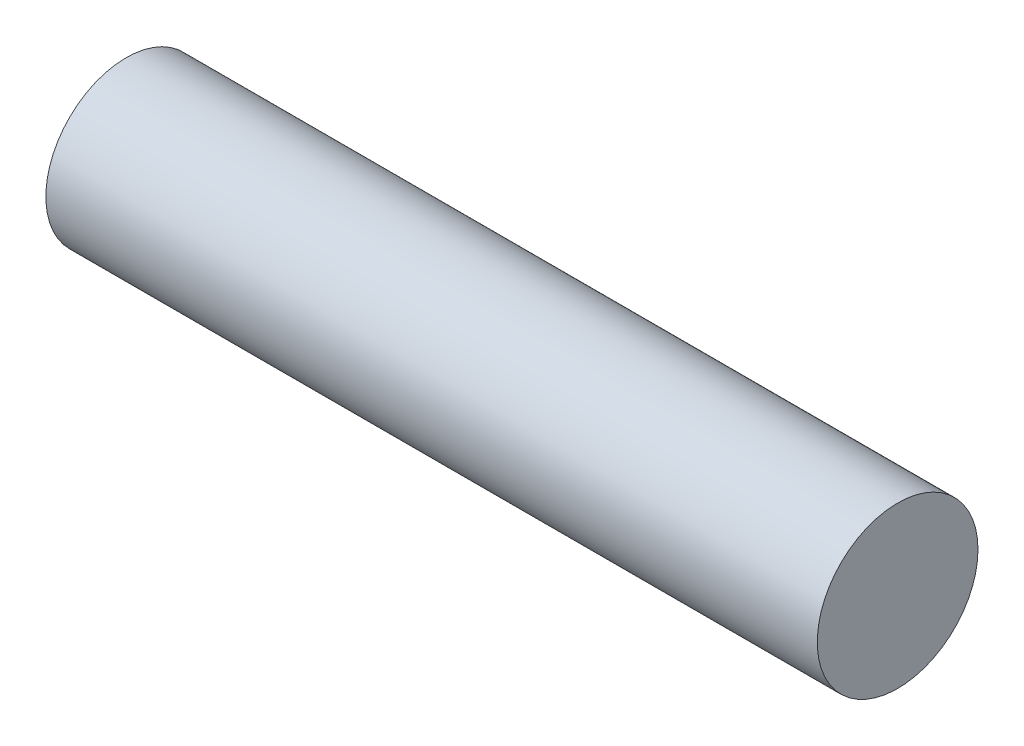
ISO-10303-21;
HEADER;
FILE_DESCRIPTION(('STEP AP214'),'2;1');
FILE_NAME('part.step','',(''),(''),'','','');
FILE_SCHEMA(('AUTOMOTIVE_DESIGN { 1 0 10303 214 1 1 1 1 }'));
ENDSEC;
DATA;
#1=APPLICATION_CONTEXT('core data for automotive mechanical design processes');
#2=APPLICATION_PROTOCOL_DEFINITION('international standard','automotive_design',2000,#1);
#3=PRODUCT_CONTEXT('',#1,'mechanical');
#4=PRODUCT('Part','Part','',(#3));
#5=PRODUCT_RELATED_PRODUCT_CATEGORY('part','',(#4));
#6=PRODUCT_DEFINITION_FORMATION('','',#4);
#7=PRODUCT_DEFINITION_CONTEXT('part definition',#1,'design');
#8=PRODUCT_DEFINITION('design','',#6,#7);
#9=PRODUCT_DEFINITION_SHAPE('','',#8);
#10=(LENGTH_UNIT() NAMED_UNIT(*) SI_UNIT(.MILLI.,.METRE.));
#11=(NAMED_UNIT(*) PLANE_ANGLE_UNIT() SI_UNIT($,.RADIAN.));
#12=(NAMED_UNIT(*) SI_UNIT($,.STERADIAN.) SOLID_ANGLE_UNIT());
#13=UNCERTAINTY_MEASURE_WITH_UNIT(LENGTH_MEASURE(1.E-05),#10,'distance_accuracy_value','');
#14=(GEOMETRIC_REPRESENTATION_CONTEXT(3) GLOBAL_UNCERTAINTY_ASSIGNED_CONTEXT((#13)) GLOBAL_UNIT_ASSIGNED_CONTEXT((#10,
#11,#12)) REPRESENTATION_CONTEXT('',''));
#15=CARTESIAN_POINT('',(0.,0.,0.));
#16=DIRECTION('',(0.,0.,1.));
#17=DIRECTION('',(1.,0.,0.));
#18=AXIS2_PLACEMENT_3D('',#15,#16,#17);
#19=CARTESIAN_POINT('',(-19.05,0.,0.));
#20=DIRECTION('',(1.,0.,0.));
#21=DIRECTION('',(0.,0.,-1.));
#22=AXIS2_PLACEMENT_3D('',#19,#20,#21);
#23=CYLINDRICAL_SURFACE('',#22,3.96875);
#24=CARTESIAN_POINT('',(-19.05,0.,0.));
#25=DIRECTION('',(1.,0.,0.));
#26=DIRECTION('',(0.,0.,-1.));
#27=AXIS2_PLACEMENT_3D('',#24,#25,#26);
#28=CIRCLE('',#27,3.96875);
#29=CARTESIAN_POINT('',(-19.05,0.,-3.96875));
#30=VERTEX_POINT('',#29);
#31=EDGE_CURVE('E10',#30,#30,#28,.T.);
#32=ORIENTED_EDGE('',*,*,#31,.T.);
#33=EDGE_LOOP('',(#32));
#34=FACE_BOUND('',#33,.T.);
#35=CARTESIAN_POINT('',(19.05,0.,0.));
#36=DIRECTION('',(1.,0.,0.));
#37=DIRECTION('',(0.,0.,-1.));
#38=AXIS2_PLACEMENT_3D('',#35,#36,#37);
#39=CIRCLE('',#38,3.96875);
#40=CARTESIAN_POINT('',(19.05,0.,-3.96875));
#41=VERTEX_POINT('',#40);
#42=EDGE_CURVE('E37',#41,#41,#39,.T.);
#43=ORIENTED_EDGE('',*,*,#42,.F.);
#44=EDGE_LOOP('',(#43));
#45=FACE_BOUND('',#44,.T.);
#46=ADVANCED_FACE('F31',(#34,#45),#23,.T.);
#47=CARTESIAN_POINT('',(-19.05,0.,0.));
#48=DIRECTION('',(1.,0.,0.));
#49=DIRECTION('',(0.,0.,-1.));
#50=AXIS2_PLACEMENT_3D('',#47,#48,#49);
#51=PLANE('',#50);
#52=ORIENTED_EDGE('',*,*,#31,.F.);
#53=EDGE_LOOP('',(#52));
#54=FACE_BOUND('',#53,.T.);
#55=ADVANCED_FACE('F46',(#54),#51,.F.);
#56=CARTESIAN_POINT('',(19.05,0.,0.));
#57=DIRECTION('',(1.,0.,0.));
#58=DIRECTION('',(0.,0.,-1.));
#59=AXIS2_PLACEMENT_3D('',#56,#57,#58);
#60=PLANE('',#59);
#61=ORIENTED_EDGE('',*,*,#42,.T.);
#62=EDGE_LOOP('',(#61));
#63=FACE_BOUND('',#62,.T.);
#64=ADVANCED_FACE('F43',(#63),#60,.T.);
#65=CLOSED_SHELL('',(#46,#55,#64));
#66=MANIFOLD_SOLID_BREP('B2',#65);
#67=ADVANCED_BREP_SHAPE_REPRESENTATION('',(#18,#66),#14);
#68=SHAPE_DEFINITION_REPRESENTATION(#9,#67);
ENDSEC;
END-ISO-10303-21;
